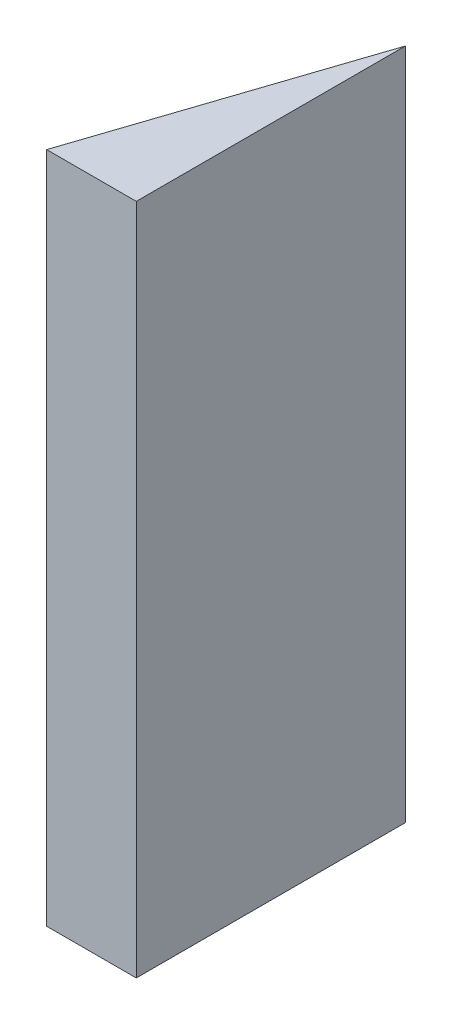
ISO-10303-21;
HEADER;
FILE_DESCRIPTION(('STEP AP214'),'2;1');
FILE_NAME('part.step','',(''),(''),'','','');
FILE_SCHEMA(('AUTOMOTIVE_DESIGN { 1 0 10303 214 1 1 1 1 }'));
ENDSEC;
DATA;
#1=APPLICATION_CONTEXT('core data for automotive mechanical design processes');
#2=APPLICATION_PROTOCOL_DEFINITION('international standard','automotive_design',2000,#1);
#3=PRODUCT_CONTEXT('',#1,'mechanical');
#4=PRODUCT('Part','Part','',(#3));
#5=PRODUCT_RELATED_PRODUCT_CATEGORY('part','',(#4));
#6=PRODUCT_DEFINITION_FORMATION('','',#4);
#7=PRODUCT_DEFINITION_CONTEXT('part definition',#1,'design');
#8=PRODUCT_DEFINITION('design','',#6,#7);
#9=PRODUCT_DEFINITION_SHAPE('','',#8);
#10=(LENGTH_UNIT() NAMED_UNIT(*) SI_UNIT(.MILLI.,.METRE.));
#11=(NAMED_UNIT(*) PLANE_ANGLE_UNIT() SI_UNIT($,.RADIAN.));
#12=(NAMED_UNIT(*) SI_UNIT($,.STERADIAN.) SOLID_ANGLE_UNIT());
#13=UNCERTAINTY_MEASURE_WITH_UNIT(LENGTH_MEASURE(1.E-05),#10,'distance_accuracy_value','');
#14=(GEOMETRIC_REPRESENTATION_CONTEXT(3) GLOBAL_UNCERTAINTY_ASSIGNED_CONTEXT((#13)) GLOBAL_UNIT_ASSIGNED_CONTEXT((#10,
#11,#12)) REPRESENTATION_CONTEXT('',''));
#15=CARTESIAN_POINT('',(0.,0.,0.));
#16=DIRECTION('',(0.,0.,1.));
#17=DIRECTION('',(1.,0.,0.));
#18=AXIS2_PLACEMENT_3D('',#15,#16,#17);
#19=CARTESIAN_POINT('',(3.91999986886585,-0.750000503554193,-3.67112145542898));
#20=DIRECTION('',(1.74845553146952E-07,1.,-8.74227765734759E-08));
#21=DIRECTION('',(-1.,1.74845553146952E-07,0.));
#22=AXIS2_PLACEMENT_3D('',#19,#20,#21);
#23=PLANE('',#22);
#24=DIRECTION('',(-0.315990463967198,1.38192968050926E-07,0.948762365759612));
#25=VECTOR('',#24,1.);
#26=CARTESIAN_POINT('',(3.89999986886585,-0.750000498308827,-3.65112145542898));
#27=LINE('',#26,#25);
#28=CARTESIAN_POINT('',(3.89999986886585,-0.750000498310826,-3.65112145542898));
#29=VERTEX_POINT('',#28);
#30=CARTESIAN_POINT('',(3.76677769422185,-0.750000440048411,-3.25112145542898));
#31=VERTEX_POINT('',#30);
#32=EDGE_CURVE('E11',#29,#31,#27,.T.);
#33=ORIENTED_EDGE('',*,*,#32,.T.);
#34=DIRECTION('',(0.999999999999985,-1.74845553322982E-07,0.));
#35=VECTOR('',#34,1.);
#36=CARTESIAN_POINT('',(3.76677769422185,-0.750000440046411,-3.25112145542898));
#37=LINE('',#36,#35);
#38=CARTESIAN_POINT('',(3.89999986886585,-0.750000463341716,-3.25112145542898));
#39=VERTEX_POINT('',#38);
#40=EDGE_CURVE('E49',#31,#39,#37,.T.);
#41=ORIENTED_EDGE('',*,*,#40,.T.);
#42=DIRECTION('',(0.,-8.74227767955202E-08,-0.999999999999996));
#43=VECTOR('',#42,1.);
#44=CARTESIAN_POINT('',(3.89999986886585,-0.750000463339716,-3.25112145542898));
#45=LINE('',#44,#43);
#46=EDGE_CURVE('E47',#39,#29,#45,.T.);
#47=ORIENTED_EDGE('',*,*,#46,.T.);
#48=EDGE_LOOP('',(#33,#41,#47));
#49=FACE_BOUND('',#48,.T.);
#50=ADVANCED_FACE('F17',(#49),#23,.T.);
#51=CARTESIAN_POINT('',(3.9199996940203,-1.75000050355519,-3.6711213680062));
#52=DIRECTION('',(1.74845553146952E-07,1.,-8.74227765734759E-08));
#53=DIRECTION('',(-1.,1.74845553146952E-07,0.));
#54=AXIS2_PLACEMENT_3D('',#51,#52,#53);
#55=PLANE('',#54);
#56=DIRECTION('',(0.,-8.74227762404087E-08,-0.999999999999996));
#57=VECTOR('',#56,1.);
#58=CARTESIAN_POINT('',(3.8999996940203,-1.75000046334072,-3.25112136800621));
#59=LINE('',#58,#57);
#60=CARTESIAN_POINT('',(3.8999996940203,-1.75000046333972,-3.2511213680062));
#61=VERTEX_POINT('',#60);
#62=CARTESIAN_POINT('',(3.8999996940203,-1.75000049830883,-3.65112136800621));
#63=VERTEX_POINT('',#62);
#64=EDGE_CURVE('E24',#61,#63,#59,.T.);
#65=ORIENTED_EDGE('',*,*,#64,.F.);
#66=DIRECTION('',(0.999999999999985,-1.74845553322983E-07,0.));
#67=VECTOR('',#66,1.);
#68=CARTESIAN_POINT('',(3.7667775193763,-1.75000044004741,-3.25112136800621));
#69=LINE('',#68,#67);
#70=CARTESIAN_POINT('',(3.7667775193763,-1.75000044004641,-3.25112136800621));
#71=VERTEX_POINT('',#70);
#72=EDGE_CURVE('E53',#71,#61,#69,.T.);
#73=ORIENTED_EDGE('',*,*,#72,.F.);
#74=DIRECTION('',(-0.315990463967198,1.38192968050925E-07,0.948762365759612));
#75=VECTOR('',#74,1.);
#76=CARTESIAN_POINT('',(3.8999996940203,-1.75000049830983,-3.65112136800621));
#77=LINE('',#76,#75);
#78=EDGE_CURVE('E68',#63,#71,#77,.T.);
#79=ORIENTED_EDGE('',*,*,#78,.F.);
#80=EDGE_LOOP('',(#65,#73,#79));
#81=FACE_BOUND('',#80,.T.);
#82=ADVANCED_FACE('F73',(#81),#55,.F.);
#83=CARTESIAN_POINT('',(3.89999986886585,-0.750000498308826,-3.65112145542898));
#84=DIRECTION('',(0.948762365759622,-1.3826211694183E-07,0.315990463967214));
#85=DIRECTION('',(-0.315990463967199,1.38192967784634E-07,0.948762365759617));
#86=AXIS2_PLACEMENT_3D('',#83,#84,#85);
#87=PLANE('',#86);
#88=DIRECTION('',(-1.74845553146774E-07,-0.999999999999981,8.74227765733868E-08));
#89=VECTOR('',#88,1.);
#90=CARTESIAN_POINT('',(3.89999986886585,-0.750000498308826,-3.65112145542898));
#91=LINE('',#90,#89);
#92=EDGE_CURVE('E59',#29,#63,#91,.T.);
#93=ORIENTED_EDGE('',*,*,#92,.T.);
#94=ORIENTED_EDGE('',*,*,#78,.T.);
#95=DIRECTION('',(-1.74845553146774E-07,-0.999999999999981,8.74227765733868E-08));
#96=VECTOR('',#95,1.);
#97=CARTESIAN_POINT('',(3.76677769422185,-0.750000440046411,-3.25112145542898));
#98=LINE('',#97,#96);
#99=EDGE_CURVE('E54',#31,#71,#98,.T.);
#100=ORIENTED_EDGE('',*,*,#99,.F.);
#101=ORIENTED_EDGE('',*,*,#32,.F.);
#102=EDGE_LOOP('',(#93,#94,#100,#101));
#103=FACE_BOUND('',#102,.T.);
#104=ADVANCED_FACE('F57',(#103),#87,.F.);
#105=CARTESIAN_POINT('',(3.76677769422185,-0.750000440046411,-3.25112145542898));
#106=DIRECTION('',(0.,-8.74227765734759E-08,-1.));
#107=DIRECTION('',(1.,-1.74845553146952E-07,0.));
#108=AXIS2_PLACEMENT_3D('',#105,#106,#107);
#109=PLANE('',#108);
#110=ORIENTED_EDGE('',*,*,#99,.T.);
#111=ORIENTED_EDGE('',*,*,#72,.T.);
#112=DIRECTION('',(-1.74845553146773E-07,-0.999999999999981,8.74227765733867E-08));
#113=VECTOR('',#112,1.);
#114=CARTESIAN_POINT('',(3.89999986886585,-0.750000463339716,-3.25112145542898));
#115=LINE('',#114,#113);
#116=EDGE_CURVE('E70',#39,#61,#115,.T.);
#117=ORIENTED_EDGE('',*,*,#116,.F.);
#118=ORIENTED_EDGE('',*,*,#40,.F.);
#119=EDGE_LOOP('',(#110,#111,#117,#118));
#120=FACE_BOUND('',#119,.T.);
#121=ADVANCED_FACE('F72',(#120),#109,.F.);
#122=CARTESIAN_POINT('',(3.89999986886585,-0.750000463339716,-3.25112145542898));
#123=DIRECTION('',(-1.,1.74845553146952E-07,0.));
#124=DIRECTION('',(0.,-8.74227765734759E-08,-1.));
#125=AXIS2_PLACEMENT_3D('',#122,#123,#124);
#126=PLANE('',#125);
#127=ORIENTED_EDGE('',*,*,#116,.T.);
#128=ORIENTED_EDGE('',*,*,#64,.T.);
#129=ORIENTED_EDGE('',*,*,#92,.F.);
#130=ORIENTED_EDGE('',*,*,#46,.F.);
#131=EDGE_LOOP('',(#127,#128,#129,#130));
#132=FACE_BOUND('',#131,.T.);
#133=ADVANCED_FACE('F61',(#132),#126,.F.);
#134=CLOSED_SHELL('',(#50,#82,#104,#121,#133));
#135=MANIFOLD_SOLID_BREP('B1',#134);
#136=ADVANCED_BREP_SHAPE_REPRESENTATION('',(#18,#135),#14);
#137=SHAPE_DEFINITION_REPRESENTATION(#9,#136);
ENDSEC;
END-ISO-10303-21;
